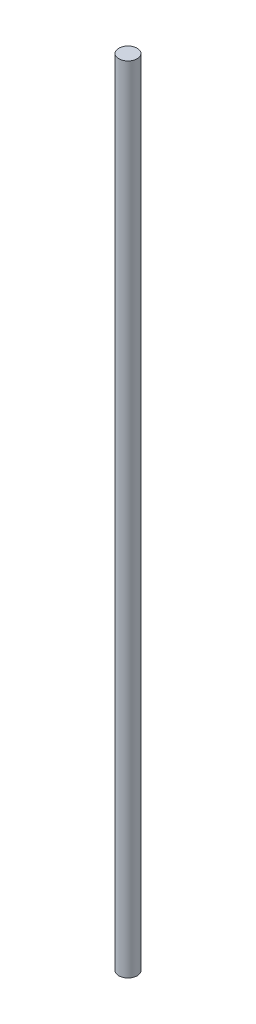
ISO-10303-21;
HEADER;
FILE_DESCRIPTION(('STEP AP214'),'2;1');
FILE_NAME('part.step','',(''),(''),'','','');
FILE_SCHEMA(('AUTOMOTIVE_DESIGN { 1 0 10303 214 1 1 1 1 }'));
ENDSEC;
DATA;
#1=APPLICATION_CONTEXT('core data for automotive mechanical design processes');
#2=APPLICATION_PROTOCOL_DEFINITION('international standard','automotive_design',2000,#1);
#3=PRODUCT_CONTEXT('',#1,'mechanical');
#4=PRODUCT('Part','Part','',(#3));
#5=PRODUCT_RELATED_PRODUCT_CATEGORY('part','',(#4));
#6=PRODUCT_DEFINITION_FORMATION('','',#4);
#7=PRODUCT_DEFINITION_CONTEXT('part definition',#1,'design');
#8=PRODUCT_DEFINITION('design','',#6,#7);
#9=PRODUCT_DEFINITION_SHAPE('','',#8);
#10=(LENGTH_UNIT() NAMED_UNIT(*) SI_UNIT(.MILLI.,.METRE.));
#11=(NAMED_UNIT(*) PLANE_ANGLE_UNIT() SI_UNIT($,.RADIAN.));
#12=(NAMED_UNIT(*) SI_UNIT($,.STERADIAN.) SOLID_ANGLE_UNIT());
#13=UNCERTAINTY_MEASURE_WITH_UNIT(LENGTH_MEASURE(1.E-05),#10,'distance_accuracy_value','');
#14=(GEOMETRIC_REPRESENTATION_CONTEXT(3) GLOBAL_UNCERTAINTY_ASSIGNED_CONTEXT((#13)) GLOBAL_UNIT_ASSIGNED_CONTEXT((#10,
#11,#12)) REPRESENTATION_CONTEXT('',''));
#15=CARTESIAN_POINT('',(0.,0.,0.));
#16=DIRECTION('',(0.,0.,1.));
#17=DIRECTION('',(1.,0.,0.));
#18=AXIS2_PLACEMENT_3D('',#15,#16,#17);
#19=CARTESIAN_POINT('',(0.,-650.,0.));
#20=DIRECTION('',(0.,1.,0.));
#21=DIRECTION('',(0.,0.,1.));
#22=AXIS2_PLACEMENT_3D('',#19,#20,#21);
#23=CYLINDRICAL_SURFACE('',#22,7.5);
#24=CARTESIAN_POINT('',(0.,-650.,0.));
#25=DIRECTION('',(0.,1.,0.));
#26=DIRECTION('',(0.,0.,1.));
#27=AXIS2_PLACEMENT_3D('',#24,#25,#26);
#28=CIRCLE('',#27,7.5);
#29=CARTESIAN_POINT('',(0.,-650.,7.5));
#30=VERTEX_POINT('',#29);
#31=EDGE_CURVE('E10',#30,#30,#28,.T.);
#32=ORIENTED_EDGE('',*,*,#31,.T.);
#33=EDGE_LOOP('',(#32));
#34=FACE_BOUND('',#33,.T.);
#35=CARTESIAN_POINT('',(0.,0.,0.));
#36=DIRECTION('',(0.,1.,0.));
#37=DIRECTION('',(0.,0.,1.));
#38=AXIS2_PLACEMENT_3D('',#35,#36,#37);
#39=CIRCLE('',#38,7.5);
#40=CARTESIAN_POINT('',(0.,0.,7.5));
#41=VERTEX_POINT('',#40);
#42=EDGE_CURVE('E40',#41,#41,#39,.T.);
#43=ORIENTED_EDGE('',*,*,#42,.F.);
#44=EDGE_LOOP('',(#43));
#45=FACE_BOUND('',#44,.T.);
#46=ADVANCED_FACE('F37',(#34,#45),#23,.T.);
#47=CARTESIAN_POINT('',(0.,-650.,0.));
#48=DIRECTION('',(0.,1.,0.));
#49=DIRECTION('',(0.,0.,1.));
#50=AXIS2_PLACEMENT_3D('',#47,#48,#49);
#51=PLANE('',#50);
#52=ORIENTED_EDGE('',*,*,#31,.F.);
#53=EDGE_LOOP('',(#52));
#54=FACE_BOUND('',#53,.T.);
#55=ADVANCED_FACE('F54',(#54),#51,.F.);
#56=CARTESIAN_POINT('',(0.,0.,0.));
#57=DIRECTION('',(0.,1.,0.));
#58=DIRECTION('',(0.,0.,1.));
#59=AXIS2_PLACEMENT_3D('',#56,#57,#58);
#60=PLANE('',#59);
#61=ORIENTED_EDGE('',*,*,#42,.T.);
#62=EDGE_LOOP('',(#61));
#63=FACE_BOUND('',#62,.T.);
#64=ADVANCED_FACE('F51',(#63),#60,.T.);
#65=CLOSED_SHELL('',(#46,#55,#64));
#66=MANIFOLD_SOLID_BREP('B2',#65);
#67=ADVANCED_BREP_SHAPE_REPRESENTATION('',(#18,#66),#14);
#68=SHAPE_DEFINITION_REPRESENTATION(#9,#67);
ENDSEC;
END-ISO-10303-21;
